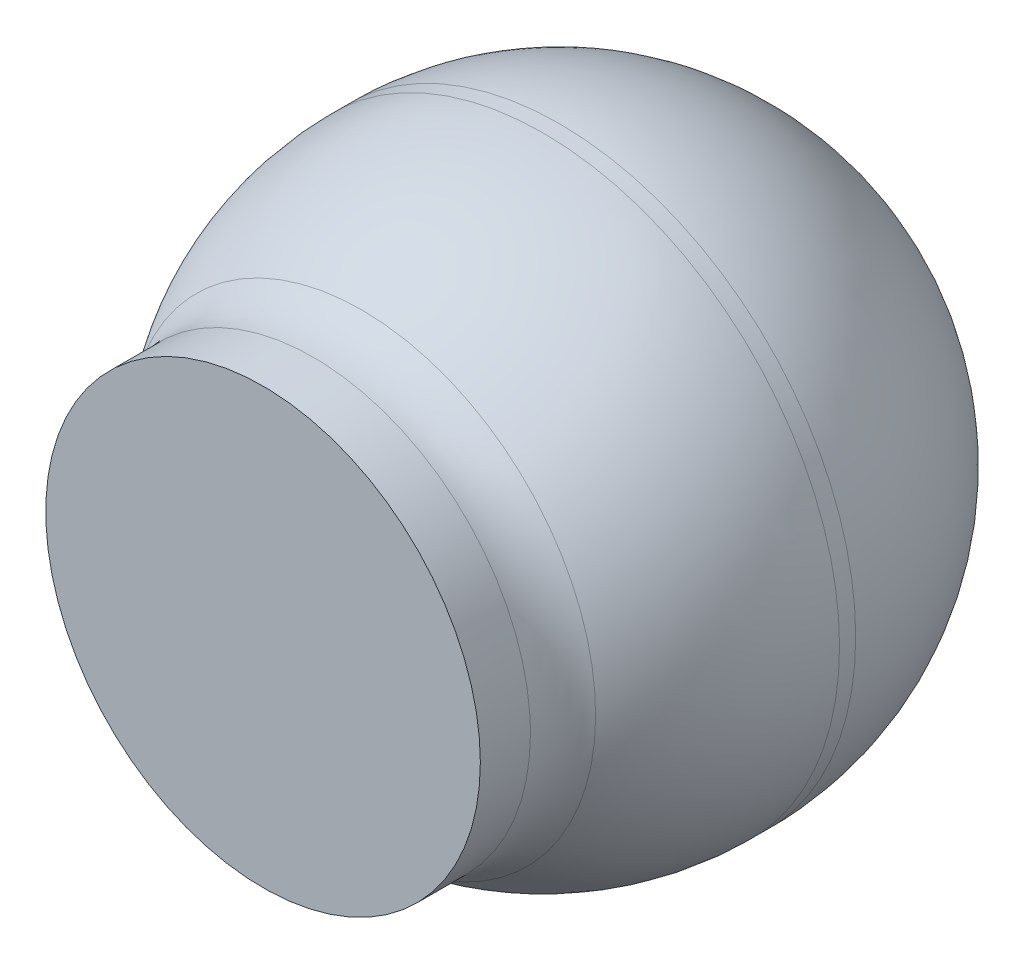
ISO-10303-21;
HEADER;
FILE_DESCRIPTION(('STEP AP214'),'2;1');
FILE_NAME('part.step','',(''),(''),'','','');
FILE_SCHEMA(('AUTOMOTIVE_DESIGN { 1 0 10303 214 1 1 1 1 }'));
ENDSEC;
DATA;
#1=APPLICATION_CONTEXT('core data for automotive mechanical design processes');
#2=APPLICATION_PROTOCOL_DEFINITION('international standard','automotive_design',2000,#1);
#3=PRODUCT_CONTEXT('',#1,'mechanical');
#4=PRODUCT('Part','Part','',(#3));
#5=PRODUCT_RELATED_PRODUCT_CATEGORY('part','',(#4));
#6=PRODUCT_DEFINITION_FORMATION('','',#4);
#7=PRODUCT_DEFINITION_CONTEXT('part definition',#1,'design');
#8=PRODUCT_DEFINITION('design','',#6,#7);
#9=PRODUCT_DEFINITION_SHAPE('','',#8);
#10=(LENGTH_UNIT() NAMED_UNIT(*) SI_UNIT(.MILLI.,.METRE.));
#11=(NAMED_UNIT(*) PLANE_ANGLE_UNIT() SI_UNIT($,.RADIAN.));
#12=(NAMED_UNIT(*) SI_UNIT($,.STERADIAN.) SOLID_ANGLE_UNIT());
#13=UNCERTAINTY_MEASURE_WITH_UNIT(LENGTH_MEASURE(1.E-05),#10,'distance_accuracy_value','');
#14=(GEOMETRIC_REPRESENTATION_CONTEXT(3) GLOBAL_UNCERTAINTY_ASSIGNED_CONTEXT((#13)) GLOBAL_UNIT_ASSIGNED_CONTEXT((#10,
#11,#12)) REPRESENTATION_CONTEXT('',''));
#15=CARTESIAN_POINT('',(0.,0.,0.));
#16=DIRECTION('',(0.,0.,1.));
#17=DIRECTION('',(1.,0.,0.));
#18=AXIS2_PLACEMENT_3D('',#15,#16,#17);
#19=CARTESIAN_POINT('',(1.977080077731,-7.861349291452,10.006534503384));
#20=DIRECTION('',(0.,0.,-1.));
#21=DIRECTION('',(-1.,0.,0.));
#22=AXIS2_PLACEMENT_3D('',#19,#20,#21);
#23=PLANE('',#22);
#24=CARTESIAN_POINT('',(1.977080077731,-7.861349291452,10.006534503384));
#25=DIRECTION('',(0.,0.,1.));
#26=DIRECTION('',(1.,0.,0.));
#27=AXIS2_PLACEMENT_3D('',#24,#25,#26);
#28=CIRCLE('',#27,0.275);
#29=CARTESIAN_POINT('',(2.252080077731,-7.861349291452,10.006534503384));
#30=VERTEX_POINT('',#29);
#31=EDGE_CURVE('E20',#30,#30,#28,.F.);
#32=ORIENTED_EDGE('',*,*,#31,.F.);
#33=EDGE_LOOP('',(#32));
#34=FACE_BOUND('',#33,.T.);
#35=ADVANCED_FACE('F17',(#34),#23,.F.);
#36=CARTESIAN_POINT('',(1.977080077731,-7.861349291452,9.906534503384));
#37=DIRECTION('',(0.,0.,1.));
#38=DIRECTION('',(1.,0.,0.));
#39=AXIS2_PLACEMENT_3D('',#36,#37,#38);
#40=CYLINDRICAL_SURFACE('',#39,0.275);
#41=CARTESIAN_POINT('',(1.977080077731,-7.861349291452,9.943180457728));
#42=DIRECTION('',(0.,0.,-1.));
#43=DIRECTION('',(0.996700902337582,0.081162252799247,0.));
#44=AXIS2_PLACEMENT_3D('',#41,#42,#43);
#45=CIRCLE('',#44,0.275);
#46=CARTESIAN_POINT('',(2.25117282587384,-7.83902967193221,9.943180457728));
#47=VERTEX_POINT('',#46);
#48=EDGE_CURVE('E65',#47,#47,#45,.F.);
#49=ORIENTED_EDGE('',*,*,#48,.T.);
#50=EDGE_LOOP('',(#49));
#51=FACE_BOUND('',#50,.T.);
#52=ORIENTED_EDGE('',*,*,#31,.T.);
#53=EDGE_LOOP('',(#52));
#54=FACE_BOUND('',#53,.T.);
#55=ADVANCED_FACE('F62',(#51,#54),#40,.T.);
#56=CARTESIAN_POINT('',(1.977080077731,-7.861349291452,9.943180457728));
#57=DIRECTION('',(0.,0.,-1.));
#58=DIRECTION('',(0.996700902337583,0.0811622527992448,0.));
#59=AXIS2_PLACEMENT_3D('',#56,#57,#58);
#60=TOROIDAL_SURFACE('',#59,0.375,0.1);
#61=ORIENTED_EDGE('',*,*,#48,.F.);
#62=EDGE_LOOP('',(#61));
#63=FACE_BOUND('',#62,.T.);
#64=CARTESIAN_POINT('',(1.977080077731,-7.861349291452,9.881744931236));
#65=DIRECTION('',(0.,0.,-1.));
#66=DIRECTION('',(-0.996700902337597,-0.0811622527990622,0.));
#67=AXIS2_PLACEMENT_3D('',#64,#65,#66);
#68=CIRCLE('',#67,0.296097046412665);
#69=CARTESIAN_POINT('',(1.681959884392,-7.885381194786,9.881744931236));
#70=VERTEX_POINT('',#69);
#71=EDGE_CURVE('E39',#70,#70,#68,.T.);
#72=ORIENTED_EDGE('',*,*,#71,.F.);
#73=EDGE_LOOP('',(#72));
#74=FACE_BOUND('',#73,.T.);
#75=ADVANCED_FACE('F57',(#63,#74),#60,.F.);
#76=CARTESIAN_POINT('',(1.603317239355,-7.891785136252,9.651976062157));
#77=CARTESIAN_POINT('',(1.603317239355,-7.891785136252,9.701461392103));
#78=CARTESIAN_POINT('',(1.611473782652,-7.891120941579,9.750947004335));
#79=CARTESIAN_POINT('',(1.627792914651,-7.889792059952,9.798626332798));
#80=CARTESIAN_POINT('',(1.651658609162,-7.887848654938,9.842699544317));
#81=CARTESIAN_POINT('',(1.681959884392,-7.885381194786,9.881744931236));
#82=(BOUNDED_CURVE() B_SPLINE_CURVE(5,(#76,#77,#78,#79,#80,#81),.UNSPECIFIED.,.F.,
.F.) B_SPLINE_CURVE_WITH_KNOTS((6,6),(0.,0.661568582165),
.UNSPECIFIED.) CURVE() GEOMETRIC_REPRESENTATION_ITEM() RATIONAL_B_SPLINE_CURVE((1.,1.,1.,1.,1.,1.)) REPRESENTATION_ITEM(''));
#83=CARTESIAN_POINT('',(1.977080077731,-7.861349291452,9.651976062157));
#84=DIRECTION('',(0.,0.,-1.));
#85=AXIS1_PLACEMENT('',#83,#84);
#86=SURFACE_OF_REVOLUTION('',#82,#85);
#87=CARTESIAN_POINT('',(1.977080077731,-7.861349291452,9.651976062157));
#88=DIRECTION('',(0.,0.,1.));
#89=DIRECTION('',(1.,0.,0.));
#90=AXIS2_PLACEMENT_3D('',#87,#88,#89);
#91=CIRCLE('',#90,0.375);
#92=CARTESIAN_POINT('',(2.352080077731,-7.861349291452,9.651976062157));
#93=VERTEX_POINT('',#92);
#94=EDGE_CURVE('E36',#93,#93,#91,.F.);
#95=ORIENTED_EDGE('',*,*,#94,.F.);
#96=EDGE_LOOP('',(#95));
#97=FACE_BOUND('',#96,.T.);
#98=ORIENTED_EDGE('',*,*,#71,.T.);
#99=EDGE_LOOP('',(#98));
#100=FACE_BOUND('',#99,.T.);
#101=ADVANCED_FACE('F53',(#97,#100),#86,.F.);
#102=CARTESIAN_POINT('',(1.977080077731,-7.861349291452,9.256534503384));
#103=DIRECTION('',(0.,0.,1.));
#104=DIRECTION('',(1.,0.,0.));
#105=AXIS2_PLACEMENT_3D('',#102,#103,#104);
#106=CYLINDRICAL_SURFACE('',#105,0.375);
#107=CARTESIAN_POINT('',(1.977080077731,-7.861349291452,9.631534503384));
#108=DIRECTION('',(0.,0.,-1.));
#109=DIRECTION('',(0.0811622527992357,-0.996700902337583,0.));
#110=AXIS2_PLACEMENT_3D('',#107,#108,#109);
#111=CIRCLE('',#110,0.375);
#112=CARTESIAN_POINT('',(2.00751592253071,-8.23511212982859,9.631534503384));
#113=VERTEX_POINT('',#112);
#114=CARTESIAN_POINT('',(1.94664423293129,-7.48758645307541,9.631534503384));
#115=VERTEX_POINT('',#114);
#116=EDGE_CURVE('E11',#113,#115,#111,.T.);
#117=ORIENTED_EDGE('',*,*,#116,.F.);
#118=CARTESIAN_POINT('',(1.977080077731,-7.861349291452,9.631534503384));
#119=DIRECTION('',(0.,0.,1.));
#120=DIRECTION('',(0.0811622527992365,-0.996700902337583,0.));
#121=AXIS2_PLACEMENT_3D('',#118,#119,#120);
#122=CIRCLE('',#121,0.375);
#123=EDGE_CURVE('E25',#115,#113,#122,.F.);
#124=ORIENTED_EDGE('',*,*,#123,.F.);
#125=EDGE_LOOP('',(#117,#124));
#126=FACE_BOUND('',#125,.T.);
#127=ORIENTED_EDGE('',*,*,#94,.T.);
#128=EDGE_LOOP('',(#127));
#129=FACE_BOUND('',#128,.T.);
#130=ADVANCED_FACE('F34',(#126,#129),#106,.T.);
#131=CARTESIAN_POINT('',(1.977080077731,-7.861349291452,9.631534503384));
#132=DIRECTION('',(0.0811622527992361,-0.996700902337583,0.));
#133=DIRECTION('',(-0.996700902337583,-0.0811622527992361,0.));
#134=AXIS2_PLACEMENT_3D('',#131,#132,#133);
#135=SPHERICAL_SURFACE('',#134,0.375);
#136=ORIENTED_EDGE('',*,*,#123,.T.);
#137=ORIENTED_EDGE('',*,*,#116,.T.);
#138=EDGE_LOOP('',(#136,#137));
#139=FACE_BOUND('',#138,.T.);
#140=ADVANCED_FACE('F32',(#139),#135,.T.);
#141=CLOSED_SHELL('',(#35,#55,#75,#101,#130,#140));
#142=MANIFOLD_SOLID_BREP('B1',#141);
#143=ADVANCED_BREP_SHAPE_REPRESENTATION('',(#18,#142),#14);
#144=SHAPE_DEFINITION_REPRESENTATION(#9,#143);
ENDSEC;
END-ISO-10303-21;
